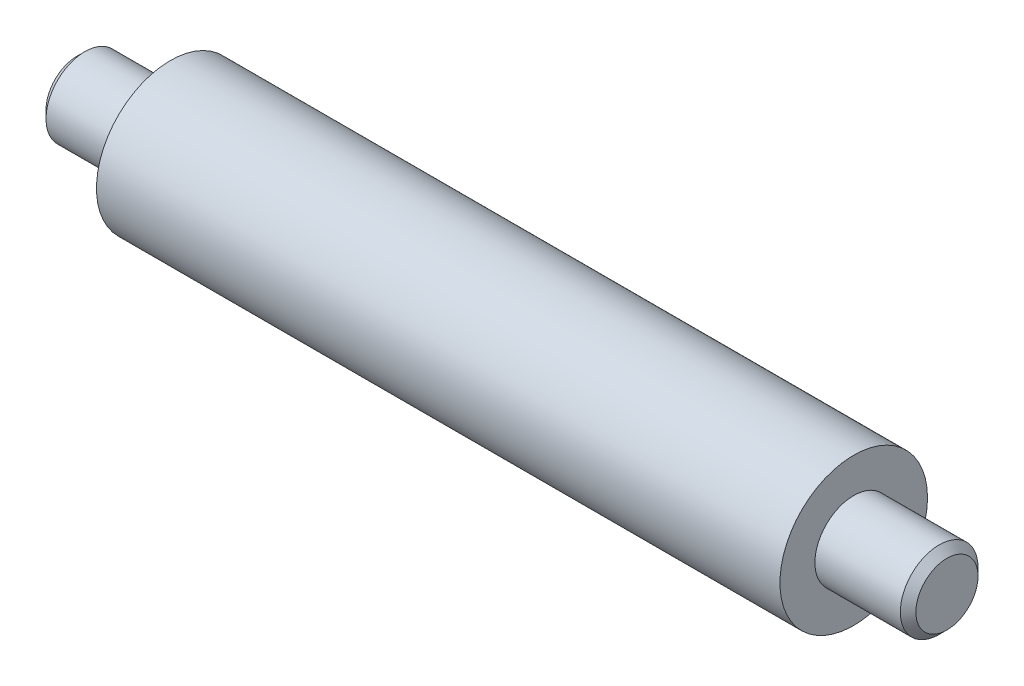
ISO-10303-21;
HEADER;
FILE_DESCRIPTION(('STEP AP214'),'2;1');
FILE_NAME('part.step','',(''),(''),'','','');
FILE_SCHEMA(('AUTOMOTIVE_DESIGN { 1 0 10303 214 1 1 1 1 }'));
ENDSEC;
DATA;
#1=APPLICATION_CONTEXT('core data for automotive mechanical design processes');
#2=APPLICATION_PROTOCOL_DEFINITION('international standard','automotive_design',2000,#1);
#3=PRODUCT_CONTEXT('',#1,'mechanical');
#4=PRODUCT('Part','Part','',(#3));
#5=PRODUCT_RELATED_PRODUCT_CATEGORY('part','',(#4));
#6=PRODUCT_DEFINITION_FORMATION('','',#4);
#7=PRODUCT_DEFINITION_CONTEXT('part definition',#1,'design');
#8=PRODUCT_DEFINITION('design','',#6,#7);
#9=PRODUCT_DEFINITION_SHAPE('','',#8);
#10=(LENGTH_UNIT() NAMED_UNIT(*) SI_UNIT(.MILLI.,.METRE.));
#11=(NAMED_UNIT(*) PLANE_ANGLE_UNIT() SI_UNIT($,.RADIAN.));
#12=(NAMED_UNIT(*) SI_UNIT($,.STERADIAN.) SOLID_ANGLE_UNIT());
#13=UNCERTAINTY_MEASURE_WITH_UNIT(LENGTH_MEASURE(1.E-05),#10,'distance_accuracy_value','');
#14=(GEOMETRIC_REPRESENTATION_CONTEXT(3) GLOBAL_UNCERTAINTY_ASSIGNED_CONTEXT((#13)) GLOBAL_UNIT_ASSIGNED_CONTEXT((#10,
#11,#12)) REPRESENTATION_CONTEXT('',''));
#15=CARTESIAN_POINT('',(0.,0.,0.));
#16=DIRECTION('',(0.,0.,1.));
#17=DIRECTION('',(1.,0.,0.));
#18=AXIS2_PLACEMENT_3D('',#15,#16,#17);
#19=CARTESIAN_POINT('',(220.,0.,0.));
#20=DIRECTION('',(-1.,0.,0.));
#21=DIRECTION('',(0.,0.,1.));
#22=AXIS2_PLACEMENT_3D('',#19,#20,#21);
#23=CYLINDRICAL_SURFACE('',#22,47.5);
#24=CARTESIAN_POINT('',(220.,0.,0.));
#25=DIRECTION('',(1.,0.,0.));
#26=DIRECTION('',(0.,0.,-1.));
#27=AXIS2_PLACEMENT_3D('',#24,#25,#26);
#28=CIRCLE('',#27,47.5);
#29=CARTESIAN_POINT('',(220.,0.,-47.5));
#30=VERTEX_POINT('',#29);
#31=EDGE_CURVE('E72',#30,#30,#28,.T.);
#32=ORIENTED_EDGE('',*,*,#31,.F.);
#33=EDGE_LOOP('',(#32));
#34=FACE_BOUND('',#33,.T.);
#35=CARTESIAN_POINT('',(-220.,0.,0.));
#36=DIRECTION('',(1.,0.,0.));
#37=DIRECTION('',(0.,0.,-1.));
#38=AXIS2_PLACEMENT_3D('',#35,#36,#37);
#39=CIRCLE('',#38,47.5);
#40=CARTESIAN_POINT('',(-220.,0.,-47.5));
#41=VERTEX_POINT('',#40);
#42=EDGE_CURVE('E73',#41,#41,#39,.T.);
#43=ORIENTED_EDGE('',*,*,#42,.T.);
#44=EDGE_LOOP('',(#43));
#45=FACE_BOUND('',#44,.T.);
#46=ADVANCED_FACE('F43',(#34,#45),#23,.T.);
#47=CARTESIAN_POINT('',(220.,0.,0.));
#48=DIRECTION('',(1.,0.,0.));
#49=DIRECTION('',(0.,0.,-1.));
#50=AXIS2_PLACEMENT_3D('',#47,#48,#49);
#51=PLANE('',#50);
#52=CARTESIAN_POINT('',(220.,0.,0.));
#53=DIRECTION('',(1.,0.,0.));
#54=DIRECTION('',(0.,0.,-1.));
#55=AXIS2_PLACEMENT_3D('',#52,#53,#54);
#56=CIRCLE('',#55,25.);
#57=CARTESIAN_POINT('',(220.,0.,-25.));
#58=VERTEX_POINT('',#57);
#59=EDGE_CURVE('E77',#58,#58,#56,.F.);
#60=ORIENTED_EDGE('',*,*,#59,.T.);
#61=EDGE_LOOP('',(#60));
#62=FACE_BOUND('',#61,.T.);
#63=ORIENTED_EDGE('',*,*,#31,.T.);
#64=EDGE_LOOP('',(#63));
#65=FACE_BOUND('',#64,.T.);
#66=ADVANCED_FACE('F85',(#62,#65),#51,.T.);
#67=CARTESIAN_POINT('',(-220.,0.,0.));
#68=DIRECTION('',(1.,0.,0.));
#69=DIRECTION('',(0.,0.,-1.));
#70=AXIS2_PLACEMENT_3D('',#67,#68,#69);
#71=PLANE('',#70);
#72=CARTESIAN_POINT('',(-220.,0.,0.));
#73=DIRECTION('',(1.,0.,0.));
#74=DIRECTION('',(0.,0.,-1.));
#75=AXIS2_PLACEMENT_3D('',#72,#73,#74);
#76=CIRCLE('',#75,25.);
#77=CARTESIAN_POINT('',(-220.,0.,-25.));
#78=VERTEX_POINT('',#77);
#79=EDGE_CURVE('E68',#78,#78,#76,.F.);
#80=ORIENTED_EDGE('',*,*,#79,.F.);
#81=EDGE_LOOP('',(#80));
#82=FACE_BOUND('',#81,.T.);
#83=ORIENTED_EDGE('',*,*,#42,.F.);
#84=EDGE_LOOP('',(#83));
#85=FACE_BOUND('',#84,.T.);
#86=ADVANCED_FACE('F109',(#82,#85),#71,.F.);
#87=CARTESIAN_POINT('',(-280.,0.,0.));
#88=DIRECTION('',(1.,0.,0.));
#89=DIRECTION('',(0.,0.,-1.));
#90=AXIS2_PLACEMENT_3D('',#87,#88,#89);
#91=PLANE('',#90);
#92=CARTESIAN_POINT('',(-280.,0.,0.));
#93=DIRECTION('',(1.,0.,0.));
#94=DIRECTION('',(0.,0.,-1.));
#95=AXIS2_PLACEMENT_3D('',#92,#93,#94);
#96=CIRCLE('',#95,20.0000000000001);
#97=CARTESIAN_POINT('',(-280.,0.,-20.0000000000001));
#98=VERTEX_POINT('',#97);
#99=EDGE_CURVE('E57',#98,#98,#96,.F.);
#100=ORIENTED_EDGE('',*,*,#99,.T.);
#101=EDGE_LOOP('',(#100));
#102=FACE_BOUND('',#101,.T.);
#103=ADVANCED_FACE('F99',(#102),#91,.F.);
#104=CARTESIAN_POINT('',(280.,0.,0.));
#105=DIRECTION('',(-1.,0.,0.));
#106=DIRECTION('',(0.,0.,1.));
#107=AXIS2_PLACEMENT_3D('',#104,#105,#106);
#108=CYLINDRICAL_SURFACE('',#107,25.);
#109=CARTESIAN_POINT('',(-275.,0.,0.));
#110=DIRECTION('',(1.,0.,0.));
#111=DIRECTION('',(0.,0.,-1.));
#112=AXIS2_PLACEMENT_3D('',#109,#110,#111);
#113=CIRCLE('',#112,25.);
#114=CARTESIAN_POINT('',(-275.,0.,-25.));
#115=VERTEX_POINT('',#114);
#116=EDGE_CURVE('E62',#115,#115,#113,.T.);
#117=ORIENTED_EDGE('',*,*,#116,.T.);
#118=EDGE_LOOP('',(#117));
#119=FACE_BOUND('',#118,.T.);
#120=ORIENTED_EDGE('',*,*,#79,.T.);
#121=EDGE_LOOP('',(#120));
#122=FACE_BOUND('',#121,.T.);
#123=ADVANCED_FACE('F91',(#119,#122),#108,.T.);
#124=CARTESIAN_POINT('',(275.,0.,0.));
#125=DIRECTION('',(1.,0.,0.));
#126=DIRECTION('',(0.,0.,-1.));
#127=AXIS2_PLACEMENT_3D('',#124,#125,#126);
#128=CIRCLE('',#127,25.);
#129=CARTESIAN_POINT('',(275.,0.,-25.));
#130=VERTEX_POINT('',#129);
#131=EDGE_CURVE('E10',#130,#130,#128,.F.);
#132=ORIENTED_EDGE('',*,*,#131,.T.);
#133=EDGE_LOOP('',(#132));
#134=FACE_BOUND('',#133,.T.);
#135=ORIENTED_EDGE('',*,*,#59,.F.);
#136=EDGE_LOOP('',(#135));
#137=FACE_BOUND('',#136,.T.);
#138=ADVANCED_FACE('F88',(#134,#137),#108,.T.);
#139=CARTESIAN_POINT('',(280.,0.,0.));
#140=DIRECTION('',(1.,0.,0.));
#141=DIRECTION('',(0.,0.,-1.));
#142=AXIS2_PLACEMENT_3D('',#139,#140,#141);
#143=PLANE('',#142);
#144=CARTESIAN_POINT('',(280.,0.,0.));
#145=DIRECTION('',(1.,0.,0.));
#146=DIRECTION('',(0.,0.,-1.));
#147=AXIS2_PLACEMENT_3D('',#144,#145,#146);
#148=CIRCLE('',#147,20.);
#149=CARTESIAN_POINT('',(280.,0.,-20.));
#150=VERTEX_POINT('',#149);
#151=EDGE_CURVE('E52',#150,#150,#148,.T.);
#152=ORIENTED_EDGE('',*,*,#151,.T.);
#153=EDGE_LOOP('',(#152));
#154=FACE_BOUND('',#153,.T.);
#155=ADVANCED_FACE('F90',(#154),#143,.T.);
#156=CARTESIAN_POINT('',(-275.,0.,0.));
#157=DIRECTION('',(1.,0.,0.));
#158=DIRECTION('',(0.,0.,-1.));
#159=AXIS2_PLACEMENT_3D('',#156,#157,#158);
#160=CONICAL_SURFACE('',#159,25.,0.785398163397446);
#161=ORIENTED_EDGE('',*,*,#99,.F.);
#162=EDGE_LOOP('',(#161));
#163=FACE_BOUND('',#162,.T.);
#164=ORIENTED_EDGE('',*,*,#116,.F.);
#165=EDGE_LOOP('',(#164));
#166=FACE_BOUND('',#165,.T.);
#167=ADVANCED_FACE('F97',(#163,#166),#160,.T.);
#168=CARTESIAN_POINT('',(280.,0.,0.));
#169=DIRECTION('',(-1.,0.,0.));
#170=DIRECTION('',(0.,0.,1.));
#171=AXIS2_PLACEMENT_3D('',#168,#169,#170);
#172=CONICAL_SURFACE('',#171,20.,0.785398163397452);
#173=ORIENTED_EDGE('',*,*,#131,.F.);
#174=EDGE_LOOP('',(#173));
#175=FACE_BOUND('',#174,.T.);
#176=ORIENTED_EDGE('',*,*,#151,.F.);
#177=EDGE_LOOP('',(#176));
#178=FACE_BOUND('',#177,.T.);
#179=ADVANCED_FACE('F46',(#175,#178),#172,.T.);
#180=CLOSED_SHELL('',(#46,#66,#86,#103,#123,#138,#155,#167,#179));
#181=MANIFOLD_SOLID_BREP('B2',#180);
#182=ADVANCED_BREP_SHAPE_REPRESENTATION('',(#18,#181),#14);
#183=SHAPE_DEFINITION_REPRESENTATION(#9,#182);
ENDSEC;
END-ISO-10303-21;
